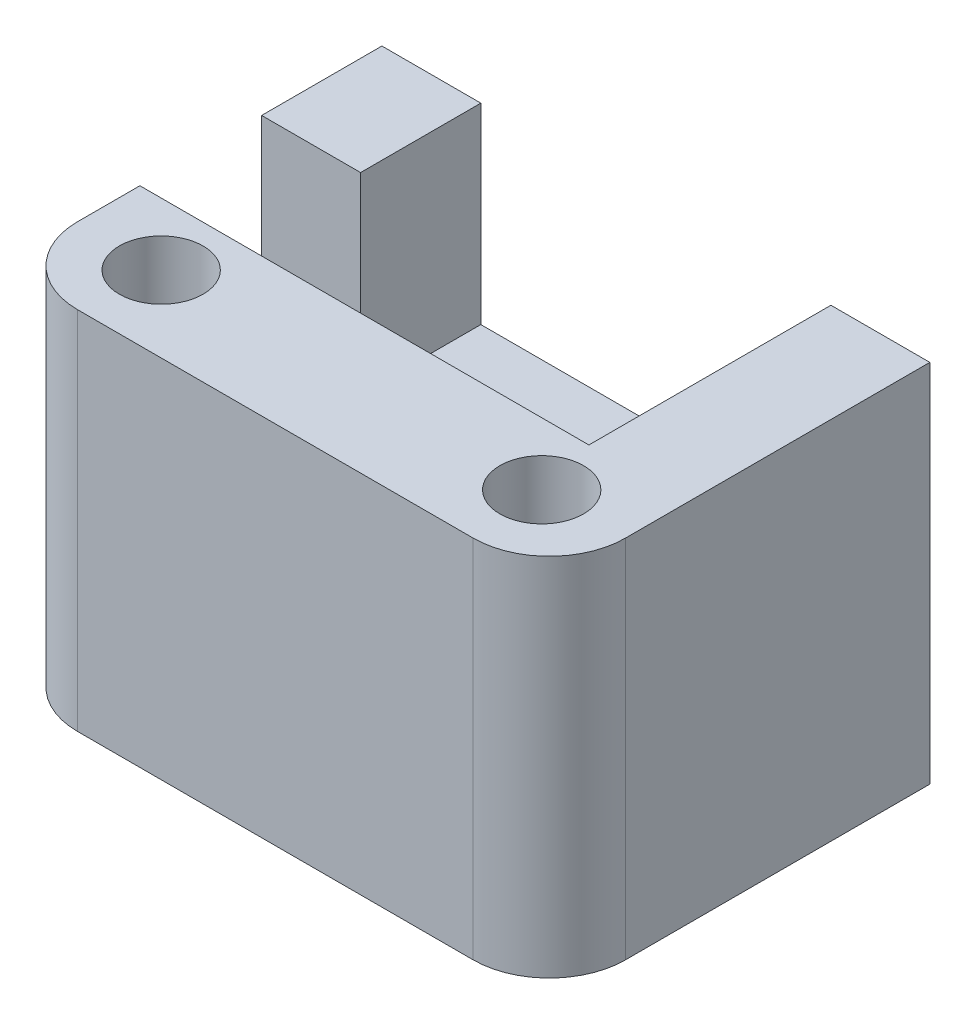
ISO-10303-21;
HEADER;
FILE_DESCRIPTION(('STEP AP214'),'2;1');
FILE_NAME('part.step','',(''),(''),'','','');
FILE_SCHEMA(('AUTOMOTIVE_DESIGN { 1 0 10303 214 1 1 1 1 }'));
ENDSEC;
DATA;
#1=APPLICATION_CONTEXT('core data for automotive mechanical design processes');
#2=APPLICATION_PROTOCOL_DEFINITION('international standard','automotive_design',2000,#1);
#3=PRODUCT_CONTEXT('',#1,'mechanical');
#4=PRODUCT('Part','Part','',(#3));
#5=PRODUCT_RELATED_PRODUCT_CATEGORY('part','',(#4));
#6=PRODUCT_DEFINITION_FORMATION('','',#4);
#7=PRODUCT_DEFINITION_CONTEXT('part definition',#1,'design');
#8=PRODUCT_DEFINITION('design','',#6,#7);
#9=PRODUCT_DEFINITION_SHAPE('','',#8);
#10=(LENGTH_UNIT() NAMED_UNIT(*) SI_UNIT(.MILLI.,.METRE.));
#11=(NAMED_UNIT(*) PLANE_ANGLE_UNIT() SI_UNIT($,.RADIAN.));
#12=(NAMED_UNIT(*) SI_UNIT($,.STERADIAN.) SOLID_ANGLE_UNIT());
#13=UNCERTAINTY_MEASURE_WITH_UNIT(LENGTH_MEASURE(1.E-05),#10,'distance_accuracy_value','');
#14=(GEOMETRIC_REPRESENTATION_CONTEXT(3) GLOBAL_UNCERTAINTY_ASSIGNED_CONTEXT((#13)) GLOBAL_UNIT_ASSIGNED_CONTEXT((#10,
#11,#12)) REPRESENTATION_CONTEXT('',''));
#15=CARTESIAN_POINT('',(0.,0.,0.));
#16=DIRECTION('',(0.,0.,1.));
#17=DIRECTION('',(1.,0.,0.));
#18=AXIS2_PLACEMENT_3D('',#15,#16,#17);
#19=CARTESIAN_POINT('',(0.,24.,0.));
#20=DIRECTION('',(0.,-1.,0.));
#21=DIRECTION('',(0.,0.,-1.));
#22=AXIS2_PLACEMENT_3D('',#19,#20,#21);
#23=PLANE('',#22);
#24=CARTESIAN_POINT('',(5.5,24.,-5.));
#25=DIRECTION('',(0.,1.,0.));
#26=DIRECTION('',(0.,0.,1.));
#27=AXIS2_PLACEMENT_3D('',#24,#25,#26);
#28=CIRCLE('',#27,2.75);
#29=CARTESIAN_POINT('',(5.5,24.,-2.25));
#30=VERTEX_POINT('',#29);
#31=EDGE_CURVE('E359',#30,#30,#28,.T.);
#32=ORIENTED_EDGE('',*,*,#31,.F.);
#33=EDGE_LOOP('',(#32));
#34=FACE_BOUND('',#33,.T.);
#35=CARTESIAN_POINT('',(30.5,24.,-5.));
#36=DIRECTION('',(0.,1.,0.));
#37=DIRECTION('',(0.,0.,1.));
#38=AXIS2_PLACEMENT_3D('',#35,#36,#37);
#39=CIRCLE('',#38,2.75);
#40=CARTESIAN_POINT('',(30.5,24.,-2.25));
#41=VERTEX_POINT('',#40);
#42=EDGE_CURVE('E347',#41,#41,#39,.T.);
#43=ORIENTED_EDGE('',*,*,#42,.F.);
#44=EDGE_LOOP('',(#43));
#45=FACE_BOUND('',#44,.T.);
#46=DIRECTION('',(0.,0.,1.));
#47=VECTOR('',#46,1.);
#48=CARTESIAN_POINT('',(0.,24.,0.));
#49=LINE('',#48,#47);
#50=CARTESIAN_POINT('',(0.,24.,-9.1));
#51=VERTEX_POINT('',#50);
#52=CARTESIAN_POINT('',(0.,24.,-5.));
#53=VERTEX_POINT('',#52);
#54=EDGE_CURVE('E157',#51,#53,#49,.T.);
#55=ORIENTED_EDGE('',*,*,#54,.T.);
#56=CARTESIAN_POINT('',(5.,24.,-5.));
#57=DIRECTION('',(0.,-1.,0.));
#58=DIRECTION('',(0.,0.,-1.));
#59=AXIS2_PLACEMENT_3D('',#56,#57,#58);
#60=CIRCLE('',#59,5.);
#61=CARTESIAN_POINT('',(5.,24.,0.));
#62=VERTEX_POINT('',#61);
#63=EDGE_CURVE('E14',#53,#62,#60,.F.);
#64=ORIENTED_EDGE('',*,*,#63,.T.);
#65=DIRECTION('',(1.,0.,0.));
#66=VECTOR('',#65,1.);
#67=CARTESIAN_POINT('',(0.,24.,0.));
#68=LINE('',#67,#66);
#69=CARTESIAN_POINT('',(31.,24.,0.));
#70=VERTEX_POINT('',#69);
#71=EDGE_CURVE('E180',#62,#70,#68,.T.);
#72=ORIENTED_EDGE('',*,*,#71,.T.);
#73=CARTESIAN_POINT('',(31.,24.,-5.));
#74=DIRECTION('',(0.,-1.,0.));
#75=DIRECTION('',(0.,0.,-1.));
#76=AXIS2_PLACEMENT_3D('',#73,#74,#75);
#77=CIRCLE('',#76,5.);
#78=CARTESIAN_POINT('',(36.,24.,-5.));
#79=VERTEX_POINT('',#78);
#80=EDGE_CURVE('E214',#70,#79,#77,.F.);
#81=ORIENTED_EDGE('',*,*,#80,.T.);
#82=DIRECTION('',(0.,0.,-1.));
#83=VECTOR('',#82,1.);
#84=CARTESIAN_POINT('',(36.,24.,0.));
#85=LINE('',#84,#83);
#86=CARTESIAN_POINT('',(36.,24.,-25.));
#87=VERTEX_POINT('',#86);
#88=EDGE_CURVE('E188',#79,#87,#85,.T.);
#89=ORIENTED_EDGE('',*,*,#88,.T.);
#90=DIRECTION('',(-1.,0.,0.));
#91=VECTOR('',#90,1.);
#92=CARTESIAN_POINT('',(0.,24.,-25.));
#93=LINE('',#92,#91);
#94=CARTESIAN_POINT('',(29.5,24.,-25.));
#95=VERTEX_POINT('',#94);
#96=EDGE_CURVE('E191',#87,#95,#93,.T.);
#97=ORIENTED_EDGE('',*,*,#96,.T.);
#98=DIRECTION('',(0.,0.,-1.));
#99=VECTOR('',#98,1.);
#100=CARTESIAN_POINT('',(29.5,24.,-25.));
#101=LINE('',#100,#99);
#102=CARTESIAN_POINT('',(29.5,24.,-9.1));
#103=VERTEX_POINT('',#102);
#104=EDGE_CURVE('E160',#103,#95,#101,.T.);
#105=ORIENTED_EDGE('',*,*,#104,.F.);
#106=DIRECTION('',(1.,0.,0.));
#107=VECTOR('',#106,1.);
#108=CARTESIAN_POINT('',(6.5,24.,-9.1));
#109=LINE('',#108,#107);
#110=EDGE_CURVE('E155',#51,#103,#109,.T.);
#111=ORIENTED_EDGE('',*,*,#110,.F.);
#112=EDGE_LOOP('',(#55,#64,#72,#81,#89,#97,#105,#111));
#113=FACE_BOUND('',#112,.T.);
#114=ADVANCED_FACE('F49',(#34,#45,#113),#23,.F.);
#115=CARTESIAN_POINT('',(0.,24.,0.));
#116=DIRECTION('',(1.,0.,0.));
#117=DIRECTION('',(0.,0.,-1.));
#118=AXIS2_PLACEMENT_3D('',#115,#116,#117);
#119=PLANE('',#118);
#120=DIRECTION('',(0.,0.,1.));
#121=VECTOR('',#120,1.);
#122=CARTESIAN_POINT('',(0.,0.,0.));
#123=LINE('',#122,#121);
#124=CARTESIAN_POINT('',(0.,0.,-25.));
#125=VERTEX_POINT('',#124);
#126=CARTESIAN_POINT('',(0.,0.,-5.));
#127=VERTEX_POINT('',#126);
#128=EDGE_CURVE('E194',#125,#127,#123,.T.);
#129=ORIENTED_EDGE('',*,*,#128,.T.);
#130=DIRECTION('',(0.,-1.,0.));
#131=VECTOR('',#130,1.);
#132=CARTESIAN_POINT('',(0.,24.,-5.));
#133=LINE('',#132,#131);
#134=EDGE_CURVE('E57',#127,#53,#133,.F.);
#135=ORIENTED_EDGE('',*,*,#134,.T.);
#136=ORIENTED_EDGE('',*,*,#54,.F.);
#137=DIRECTION('',(0.,1.,0.));
#138=VECTOR('',#137,1.);
#139=CARTESIAN_POINT('',(0.,24.,-9.1));
#140=LINE('',#139,#138);
#141=CARTESIAN_POINT('',(0.,14.,-9.1));
#142=VERTEX_POINT('',#141);
#143=EDGE_CURVE('E167',#142,#51,#140,.T.);
#144=ORIENTED_EDGE('',*,*,#143,.F.);
#145=DIRECTION('',(0.,0.,1.));
#146=VECTOR('',#145,1.);
#147=CARTESIAN_POINT('',(0.,14.,-9.1));
#148=LINE('',#147,#146);
#149=CARTESIAN_POINT('',(0.,14.,-17.1));
#150=VERTEX_POINT('',#149);
#151=EDGE_CURVE('E332',#150,#142,#148,.T.);
#152=ORIENTED_EDGE('',*,*,#151,.F.);
#153=DIRECTION('',(0.,-1.,0.));
#154=VECTOR('',#153,1.);
#155=CARTESIAN_POINT('',(0.,24.,-17.1));
#156=LINE('',#155,#154);
#157=CARTESIAN_POINT('',(0.,24.,-17.1));
#158=VERTEX_POINT('',#157);
#159=EDGE_CURVE('E173',#158,#150,#156,.T.);
#160=ORIENTED_EDGE('',*,*,#159,.F.);
#161=CARTESIAN_POINT('',(0.,24.,-25.));
#162=VERTEX_POINT('',#161);
#163=EDGE_CURVE('E176',#162,#158,#49,.T.);
#164=ORIENTED_EDGE('',*,*,#163,.F.);
#165=DIRECTION('',(0.,-1.,0.));
#166=VECTOR('',#165,1.);
#167=CARTESIAN_POINT('',(0.,24.,-25.));
#168=LINE('',#167,#166);
#169=EDGE_CURVE('E193',#162,#125,#168,.T.);
#170=ORIENTED_EDGE('',*,*,#169,.T.);
#171=EDGE_LOOP('',(#129,#135,#136,#144,#152,#160,#164,#170));
#172=FACE_BOUND('',#171,.T.);
#173=ADVANCED_FACE('F175',(#172),#119,.F.);
#174=CARTESIAN_POINT('',(0.,24.,0.));
#175=DIRECTION('',(0.,0.,-1.));
#176=DIRECTION('',(-1.,0.,0.));
#177=AXIS2_PLACEMENT_3D('',#174,#175,#176);
#178=PLANE('',#177);
#179=ORIENTED_EDGE('',*,*,#71,.F.);
#180=DIRECTION('',(0.,-1.,0.));
#181=VECTOR('',#180,1.);
#182=CARTESIAN_POINT('',(5.,24.,0.));
#183=LINE('',#182,#181);
#184=CARTESIAN_POINT('',(5.,0.,0.));
#185=VERTEX_POINT('',#184);
#186=EDGE_CURVE('E222',#62,#185,#183,.T.);
#187=ORIENTED_EDGE('',*,*,#186,.T.);
#188=DIRECTION('',(1.,0.,0.));
#189=VECTOR('',#188,1.);
#190=CARTESIAN_POINT('',(0.,0.,0.));
#191=LINE('',#190,#189);
#192=CARTESIAN_POINT('',(31.,0.,0.));
#193=VERTEX_POINT('',#192);
#194=EDGE_CURVE('E196',#185,#193,#191,.T.);
#195=ORIENTED_EDGE('',*,*,#194,.T.);
#196=DIRECTION('',(0.,-1.,0.));
#197=VECTOR('',#196,1.);
#198=CARTESIAN_POINT('',(31.,24.,0.));
#199=LINE('',#198,#197);
#200=EDGE_CURVE('E211',#193,#70,#199,.F.);
#201=ORIENTED_EDGE('',*,*,#200,.T.);
#202=EDGE_LOOP('',(#179,#187,#195,#201));
#203=FACE_BOUND('',#202,.T.);
#204=ADVANCED_FACE('F228',(#203),#178,.F.);
#205=CARTESIAN_POINT('',(36.,24.,0.));
#206=DIRECTION('',(-1.,0.,0.));
#207=DIRECTION('',(0.,0.,1.));
#208=AXIS2_PLACEMENT_3D('',#205,#206,#207);
#209=PLANE('',#208);
#210=ORIENTED_EDGE('',*,*,#88,.F.);
#211=DIRECTION('',(0.,-1.,0.));
#212=VECTOR('',#211,1.);
#213=CARTESIAN_POINT('',(36.,24.,-5.));
#214=LINE('',#213,#212);
#215=CARTESIAN_POINT('',(36.,0.,-5.));
#216=VERTEX_POINT('',#215);
#217=EDGE_CURVE('E205',#79,#216,#214,.T.);
#218=ORIENTED_EDGE('',*,*,#217,.T.);
#219=DIRECTION('',(0.,0.,-1.));
#220=VECTOR('',#219,1.);
#221=CARTESIAN_POINT('',(36.,0.,0.));
#222=LINE('',#221,#220);
#223=CARTESIAN_POINT('',(36.,0.,-25.));
#224=VERTEX_POINT('',#223);
#225=EDGE_CURVE('E181',#216,#224,#222,.T.);
#226=ORIENTED_EDGE('',*,*,#225,.T.);
#227=DIRECTION('',(0.,-1.,0.));
#228=VECTOR('',#227,1.);
#229=CARTESIAN_POINT('',(36.,24.,-25.));
#230=LINE('',#229,#228);
#231=EDGE_CURVE('E202',#87,#224,#230,.T.);
#232=ORIENTED_EDGE('',*,*,#231,.F.);
#233=EDGE_LOOP('',(#210,#218,#226,#232));
#234=FACE_BOUND('',#233,.T.);
#235=ADVANCED_FACE('F241',(#234),#209,.F.);
#236=CARTESIAN_POINT('',(0.,24.,-25.));
#237=DIRECTION('',(0.,0.,1.));
#238=DIRECTION('',(1.,0.,0.));
#239=AXIS2_PLACEMENT_3D('',#236,#237,#238);
#240=PLANE('',#239);
#241=CARTESIAN_POINT('',(32.5,17.7,-25.));
#242=DIRECTION('',(0.,0.,-1.));
#243=DIRECTION('',(-1.,0.,0.));
#244=AXIS2_PLACEMENT_3D('',#241,#242,#243);
#245=CIRCLE('',#244,1.025);
#246=CARTESIAN_POINT('',(31.475,17.7,-25.));
#247=VERTEX_POINT('',#246);
#248=EDGE_CURVE('E371',#247,#247,#245,.T.);
#249=ORIENTED_EDGE('',*,*,#248,.F.);
#250=EDGE_LOOP('',(#249));
#251=FACE_BOUND('',#250,.T.);
#252=CARTESIAN_POINT('',(3.5,17.7,-25.));
#253=DIRECTION('',(0.,0.,-1.));
#254=DIRECTION('',(-1.,0.,0.));
#255=AXIS2_PLACEMENT_3D('',#252,#253,#254);
#256=CIRCLE('',#255,1.025);
#257=CARTESIAN_POINT('',(2.475,17.7,-25.));
#258=VERTEX_POINT('',#257);
#259=EDGE_CURVE('E376',#258,#258,#256,.T.);
#260=ORIENTED_EDGE('',*,*,#259,.F.);
#261=EDGE_LOOP('',(#260));
#262=FACE_BOUND('',#261,.T.);
#263=CARTESIAN_POINT('',(6.5,24.,-25.));
#264=VERTEX_POINT('',#263);
#265=EDGE_CURVE('E190',#264,#162,#93,.T.);
#266=ORIENTED_EDGE('',*,*,#265,.F.);
#267=DIRECTION('',(0.,1.,0.));
#268=VECTOR('',#267,1.);
#269=CARTESIAN_POINT('',(6.5,11.4,-25.));
#270=LINE('',#269,#268);
#271=CARTESIAN_POINT('',(6.5,11.4,-25.));
#272=VERTEX_POINT('',#271);
#273=EDGE_CURVE('E197',#272,#264,#270,.T.);
#274=ORIENTED_EDGE('',*,*,#273,.F.);
#275=DIRECTION('',(-1.,0.,0.));
#276=VECTOR('',#275,1.);
#277=CARTESIAN_POINT('',(6.5,11.4,-25.));
#278=LINE('',#277,#276);
#279=CARTESIAN_POINT('',(29.5,11.4,-25.));
#280=VERTEX_POINT('',#279);
#281=EDGE_CURVE('E251',#280,#272,#278,.T.);
#282=ORIENTED_EDGE('',*,*,#281,.F.);
#283=DIRECTION('',(0.,1.,0.));
#284=VECTOR('',#283,1.);
#285=CARTESIAN_POINT('',(29.5,11.4,-25.));
#286=LINE('',#285,#284);
#287=EDGE_CURVE('E248',#280,#95,#286,.T.);
#288=ORIENTED_EDGE('',*,*,#287,.T.);
#289=ORIENTED_EDGE('',*,*,#96,.F.);
#290=ORIENTED_EDGE('',*,*,#231,.T.);
#291=DIRECTION('',(-1.,0.,0.));
#292=VECTOR('',#291,1.);
#293=CARTESIAN_POINT('',(0.,0.,-25.));
#294=LINE('',#293,#292);
#295=EDGE_CURVE('E177',#224,#125,#294,.T.);
#296=ORIENTED_EDGE('',*,*,#295,.T.);
#297=ORIENTED_EDGE('',*,*,#169,.F.);
#298=EDGE_LOOP('',(#266,#274,#282,#288,#289,#290,#296,#297));
#299=FACE_BOUND('',#298,.T.);
#300=ADVANCED_FACE('F246',(#251,#262,#299),#240,.F.);
#301=ORIENTED_EDGE('',*,*,#163,.T.);
#302=DIRECTION('',(-1.,0.,0.));
#303=VECTOR('',#302,1.);
#304=CARTESIAN_POINT('',(10.,24.,-17.1));
#305=LINE('',#304,#303);
#306=CARTESIAN_POINT('',(6.5,24.,-17.1));
#307=VERTEX_POINT('',#306);
#308=EDGE_CURVE('E328',#307,#158,#305,.T.);
#309=ORIENTED_EDGE('',*,*,#308,.F.);
#310=DIRECTION('',(0.,0.,1.));
#311=VECTOR('',#310,1.);
#312=CARTESIAN_POINT('',(6.5,24.,-25.));
#313=LINE('',#312,#311);
#314=EDGE_CURVE('E164',#264,#307,#313,.T.);
#315=ORIENTED_EDGE('',*,*,#314,.F.);
#316=ORIENTED_EDGE('',*,*,#265,.T.);
#317=EDGE_LOOP('',(#301,#309,#315,#316));
#318=FACE_BOUND('',#317,.T.);
#319=ADVANCED_FACE('F308',(#318),#23,.F.);
#320=CARTESIAN_POINT('',(0.,0.,0.));
#321=DIRECTION('',(0.,-1.,0.));
#322=DIRECTION('',(0.,0.,-1.));
#323=AXIS2_PLACEMENT_3D('',#320,#321,#322);
#324=PLANE('',#323);
#325=CARTESIAN_POINT('',(30.5,0.,-5.));
#326=DIRECTION('',(0.,1.,0.));
#327=DIRECTION('',(0.,0.,1.));
#328=AXIS2_PLACEMENT_3D('',#325,#326,#327);
#329=CIRCLE('',#328,1.49999999999999);
#330=CARTESIAN_POINT('',(30.5,0.,-3.50000000000001));
#331=VERTEX_POINT('',#330);
#332=EDGE_CURVE('E356',#331,#331,#329,.T.);
#333=ORIENTED_EDGE('',*,*,#332,.T.);
#334=EDGE_LOOP('',(#333));
#335=FACE_BOUND('',#334,.T.);
#336=CARTESIAN_POINT('',(5.5,0.,-5.));
#337=DIRECTION('',(0.,1.,0.));
#338=DIRECTION('',(0.,0.,1.));
#339=AXIS2_PLACEMENT_3D('',#336,#337,#338);
#340=CIRCLE('',#339,1.49999999999999);
#341=CARTESIAN_POINT('',(5.5,0.,-3.5));
#342=VERTEX_POINT('',#341);
#343=EDGE_CURVE('E368',#342,#342,#340,.T.);
#344=ORIENTED_EDGE('',*,*,#343,.T.);
#345=EDGE_LOOP('',(#344));
#346=FACE_BOUND('',#345,.T.);
#347=ORIENTED_EDGE('',*,*,#194,.F.);
#348=CARTESIAN_POINT('',(5.,0.,-5.));
#349=DIRECTION('',(0.,-1.,0.));
#350=DIRECTION('',(0.,0.,-1.));
#351=AXIS2_PLACEMENT_3D('',#348,#349,#350);
#352=CIRCLE('',#351,5.);
#353=EDGE_CURVE('E71',#185,#127,#352,.T.);
#354=ORIENTED_EDGE('',*,*,#353,.T.);
#355=ORIENTED_EDGE('',*,*,#128,.F.);
#356=ORIENTED_EDGE('',*,*,#295,.F.);
#357=ORIENTED_EDGE('',*,*,#225,.F.);
#358=CARTESIAN_POINT('',(31.,0.,-5.));
#359=DIRECTION('',(0.,-1.,0.));
#360=DIRECTION('',(0.,0.,-1.));
#361=AXIS2_PLACEMENT_3D('',#358,#359,#360);
#362=CIRCLE('',#361,5.);
#363=EDGE_CURVE('E208',#216,#193,#362,.T.);
#364=ORIENTED_EDGE('',*,*,#363,.T.);
#365=EDGE_LOOP('',(#347,#354,#355,#356,#357,#364));
#366=FACE_BOUND('',#365,.T.);
#367=ADVANCED_FACE('F230',(#335,#346,#366),#324,.T.);
#368=CARTESIAN_POINT('',(6.5,11.4,-25.));
#369=DIRECTION('',(-1.,0.,0.));
#370=DIRECTION('',(0.,0.,1.));
#371=AXIS2_PLACEMENT_3D('',#368,#369,#370);
#372=PLANE('',#371);
#373=DIRECTION('',(0.,-1.,0.));
#374=VECTOR('',#373,1.);
#375=CARTESIAN_POINT('',(6.5,11.4,-17.1));
#376=LINE('',#375,#374);
#377=CARTESIAN_POINT('',(6.5,14.,-17.1));
#378=VERTEX_POINT('',#377);
#379=EDGE_CURVE('E219',#307,#378,#376,.T.);
#380=ORIENTED_EDGE('',*,*,#379,.T.);
#381=DIRECTION('',(0.,0.,1.));
#382=VECTOR('',#381,1.);
#383=CARTESIAN_POINT('',(6.5,14.,-25.));
#384=LINE('',#383,#382);
#385=CARTESIAN_POINT('',(6.5,14.,-14.1));
#386=VERTEX_POINT('',#385);
#387=EDGE_CURVE('E344',#378,#386,#384,.T.);
#388=ORIENTED_EDGE('',*,*,#387,.T.);
#389=DIRECTION('',(0.,1.,0.));
#390=VECTOR('',#389,1.);
#391=CARTESIAN_POINT('',(6.5,11.4,-14.1));
#392=LINE('',#391,#390);
#393=CARTESIAN_POINT('',(6.5,11.4,-14.1));
#394=VERTEX_POINT('',#393);
#395=EDGE_CURVE('E185',#394,#386,#392,.T.);
#396=ORIENTED_EDGE('',*,*,#395,.F.);
#397=DIRECTION('',(0.,0.,1.));
#398=VECTOR('',#397,1.);
#399=CARTESIAN_POINT('',(6.5,11.4,-25.));
#400=LINE('',#399,#398);
#401=EDGE_CURVE('E280',#272,#394,#400,.T.);
#402=ORIENTED_EDGE('',*,*,#401,.F.);
#403=ORIENTED_EDGE('',*,*,#273,.T.);
#404=ORIENTED_EDGE('',*,*,#314,.T.);
#405=EDGE_LOOP('',(#380,#388,#396,#402,#403,#404));
#406=FACE_BOUND('',#405,.T.);
#407=ADVANCED_FACE('F294',(#406),#372,.F.);
#408=CARTESIAN_POINT('',(29.5,11.4,-25.));
#409=DIRECTION('',(1.,0.,0.));
#410=DIRECTION('',(0.,0.,-1.));
#411=AXIS2_PLACEMENT_3D('',#408,#409,#410);
#412=PLANE('',#411);
#413=ORIENTED_EDGE('',*,*,#104,.T.);
#414=ORIENTED_EDGE('',*,*,#287,.F.);
#415=DIRECTION('',(0.,0.,-1.));
#416=VECTOR('',#415,1.);
#417=CARTESIAN_POINT('',(29.5,11.4,-25.));
#418=LINE('',#417,#416);
#419=CARTESIAN_POINT('',(29.5,11.4,-9.1));
#420=VERTEX_POINT('',#419);
#421=EDGE_CURVE('E270',#420,#280,#418,.T.);
#422=ORIENTED_EDGE('',*,*,#421,.F.);
#423=DIRECTION('',(0.,1.,0.));
#424=VECTOR('',#423,1.);
#425=CARTESIAN_POINT('',(29.5,11.4,-9.1));
#426=LINE('',#425,#424);
#427=EDGE_CURVE('E255',#420,#103,#426,.T.);
#428=ORIENTED_EDGE('',*,*,#427,.T.);
#429=EDGE_LOOP('',(#413,#414,#422,#428));
#430=FACE_BOUND('',#429,.T.);
#431=ADVANCED_FACE('F292',(#430),#412,.F.);
#432=CARTESIAN_POINT('',(6.5,11.4,-9.1));
#433=DIRECTION('',(0.,0.,1.));
#434=DIRECTION('',(1.,0.,0.));
#435=AXIS2_PLACEMENT_3D('',#432,#433,#434);
#436=PLANE('',#435);
#437=DIRECTION('',(0.,1.,0.));
#438=VECTOR('',#437,1.);
#439=CARTESIAN_POINT('',(5.5,11.4,-9.1));
#440=LINE('',#439,#438);
#441=CARTESIAN_POINT('',(5.5,11.4,-9.1));
#442=VERTEX_POINT('',#441);
#443=CARTESIAN_POINT('',(5.5,14.,-9.1));
#444=VERTEX_POINT('',#443);
#445=EDGE_CURVE('E258',#442,#444,#440,.T.);
#446=ORIENTED_EDGE('',*,*,#445,.T.);
#447=DIRECTION('',(-1.,0.,0.));
#448=VECTOR('',#447,1.);
#449=CARTESIAN_POINT('',(10.,14.,-9.1));
#450=LINE('',#449,#448);
#451=EDGE_CURVE('E170',#444,#142,#450,.T.);
#452=ORIENTED_EDGE('',*,*,#451,.T.);
#453=ORIENTED_EDGE('',*,*,#143,.T.);
#454=ORIENTED_EDGE('',*,*,#110,.T.);
#455=ORIENTED_EDGE('',*,*,#427,.F.);
#456=DIRECTION('',(1.,0.,0.));
#457=VECTOR('',#456,1.);
#458=CARTESIAN_POINT('',(6.5,11.4,-9.1));
#459=LINE('',#458,#457);
#460=EDGE_CURVE('E274',#442,#420,#459,.T.);
#461=ORIENTED_EDGE('',*,*,#460,.F.);
#462=EDGE_LOOP('',(#446,#452,#453,#454,#455,#461));
#463=FACE_BOUND('',#462,.T.);
#464=ADVANCED_FACE('F169',(#463),#436,.F.);
#465=CARTESIAN_POINT('',(5.5,11.4,-9.1));
#466=DIRECTION('',(-1.,0.,0.));
#467=DIRECTION('',(0.,0.,1.));
#468=AXIS2_PLACEMENT_3D('',#465,#466,#467);
#469=PLANE('',#468);
#470=DIRECTION('',(0.,1.,0.));
#471=VECTOR('',#470,1.);
#472=CARTESIAN_POINT('',(5.5,11.4,-14.1));
#473=LINE('',#472,#471);
#474=CARTESIAN_POINT('',(5.5,11.4,-14.1));
#475=VERTEX_POINT('',#474);
#476=CARTESIAN_POINT('',(5.5,14.,-14.1));
#477=VERTEX_POINT('',#476);
#478=EDGE_CURVE('E262',#475,#477,#473,.T.);
#479=ORIENTED_EDGE('',*,*,#478,.T.);
#480=DIRECTION('',(0.,0.,1.));
#481=VECTOR('',#480,1.);
#482=CARTESIAN_POINT('',(5.5,14.,-9.1));
#483=LINE('',#482,#481);
#484=EDGE_CURVE('E339',#477,#444,#483,.T.);
#485=ORIENTED_EDGE('',*,*,#484,.T.);
#486=ORIENTED_EDGE('',*,*,#445,.F.);
#487=DIRECTION('',(0.,0.,1.));
#488=VECTOR('',#487,1.);
#489=CARTESIAN_POINT('',(5.5,11.4,-9.1));
#490=LINE('',#489,#488);
#491=EDGE_CURVE('E284',#475,#442,#490,.T.);
#492=ORIENTED_EDGE('',*,*,#491,.F.);
#493=EDGE_LOOP('',(#479,#485,#486,#492));
#494=FACE_BOUND('',#493,.T.);
#495=ADVANCED_FACE('F300',(#494),#469,.F.);
#496=CARTESIAN_POINT('',(6.5,11.4,-14.1));
#497=DIRECTION('',(0.,0.,-1.));
#498=DIRECTION('',(-1.,0.,0.));
#499=AXIS2_PLACEMENT_3D('',#496,#497,#498);
#500=PLANE('',#499);
#501=ORIENTED_EDGE('',*,*,#395,.T.);
#502=DIRECTION('',(-1.,0.,0.));
#503=VECTOR('',#502,1.);
#504=CARTESIAN_POINT('',(6.5,14.,-14.1));
#505=LINE('',#504,#503);
#506=EDGE_CURVE('E216',#386,#477,#505,.T.);
#507=ORIENTED_EDGE('',*,*,#506,.T.);
#508=ORIENTED_EDGE('',*,*,#478,.F.);
#509=DIRECTION('',(-1.,0.,0.));
#510=VECTOR('',#509,1.);
#511=CARTESIAN_POINT('',(6.5,11.4,-14.1));
#512=LINE('',#511,#510);
#513=EDGE_CURVE('E281',#394,#475,#512,.T.);
#514=ORIENTED_EDGE('',*,*,#513,.F.);
#515=EDGE_LOOP('',(#501,#507,#508,#514));
#516=FACE_BOUND('',#515,.T.);
#517=ADVANCED_FACE('F399',(#516),#500,.F.);
#518=CARTESIAN_POINT('',(0.,11.4,0.));
#519=DIRECTION('',(0.,-1.,0.));
#520=DIRECTION('',(0.,0.,-1.));
#521=AXIS2_PLACEMENT_3D('',#518,#519,#520);
#522=PLANE('',#521);
#523=ORIENTED_EDGE('',*,*,#401,.T.);
#524=ORIENTED_EDGE('',*,*,#513,.T.);
#525=ORIENTED_EDGE('',*,*,#491,.T.);
#526=ORIENTED_EDGE('',*,*,#460,.T.);
#527=ORIENTED_EDGE('',*,*,#421,.T.);
#528=ORIENTED_EDGE('',*,*,#281,.T.);
#529=EDGE_LOOP('',(#523,#524,#525,#526,#527,#528));
#530=FACE_BOUND('',#529,.T.);
#531=ADVANCED_FACE('F291',(#530),#522,.F.);
#532=CARTESIAN_POINT('',(3.5,17.7,-19.));
#533=DIRECTION('',(0.,0.,1.));
#534=DIRECTION('',(1.,0.,0.));
#535=AXIS2_PLACEMENT_3D('',#532,#533,#534);
#536=PLANE('',#535);
#537=CARTESIAN_POINT('',(3.5,17.7,-19.));
#538=DIRECTION('',(0.,0.,-1.));
#539=DIRECTION('',(-1.,0.,0.));
#540=AXIS2_PLACEMENT_3D('',#537,#538,#539);
#541=CIRCLE('',#540,1.025);
#542=CARTESIAN_POINT('',(2.475,17.7,-19.));
#543=VERTEX_POINT('',#542);
#544=EDGE_CURVE('E279',#543,#543,#541,.T.);
#545=ORIENTED_EDGE('',*,*,#544,.T.);
#546=EDGE_LOOP('',(#545));
#547=FACE_BOUND('',#546,.T.);
#548=ADVANCED_FACE('F383',(#547),#536,.F.);
#549=CARTESIAN_POINT('',(3.5,17.7,-25.));
#550=DIRECTION('',(0.,0.,-1.));
#551=DIRECTION('',(-1.,0.,0.));
#552=AXIS2_PLACEMENT_3D('',#549,#550,#551);
#553=CYLINDRICAL_SURFACE('',#552,1.025);
#554=ORIENTED_EDGE('',*,*,#544,.F.);
#555=EDGE_LOOP('',(#554));
#556=FACE_BOUND('',#555,.T.);
#557=ORIENTED_EDGE('',*,*,#259,.T.);
#558=EDGE_LOOP('',(#557));
#559=FACE_BOUND('',#558,.T.);
#560=ADVANCED_FACE('F385',(#556,#559),#553,.F.);
#561=CARTESIAN_POINT('',(32.5,17.7,-19.));
#562=DIRECTION('',(0.,0.,1.));
#563=DIRECTION('',(1.,0.,0.));
#564=AXIS2_PLACEMENT_3D('',#561,#562,#563);
#565=PLANE('',#564);
#566=CARTESIAN_POINT('',(32.5,17.7,-19.));
#567=DIRECTION('',(0.,0.,-1.));
#568=DIRECTION('',(-1.,0.,0.));
#569=AXIS2_PLACEMENT_3D('',#566,#567,#568);
#570=CIRCLE('',#569,1.025);
#571=CARTESIAN_POINT('',(31.475,17.7,-19.));
#572=VERTEX_POINT('',#571);
#573=EDGE_CURVE('E374',#572,#572,#570,.T.);
#574=ORIENTED_EDGE('',*,*,#573,.T.);
#575=EDGE_LOOP('',(#574));
#576=FACE_BOUND('',#575,.T.);
#577=ADVANCED_FACE('F387',(#576),#565,.F.);
#578=CARTESIAN_POINT('',(32.5,17.7,-25.));
#579=DIRECTION('',(0.,0.,-1.));
#580=DIRECTION('',(-1.,0.,0.));
#581=AXIS2_PLACEMENT_3D('',#578,#579,#580);
#582=CYLINDRICAL_SURFACE('',#581,1.025);
#583=ORIENTED_EDGE('',*,*,#573,.F.);
#584=EDGE_LOOP('',(#583));
#585=FACE_BOUND('',#584,.T.);
#586=ORIENTED_EDGE('',*,*,#248,.T.);
#587=EDGE_LOOP('',(#586));
#588=FACE_BOUND('',#587,.T.);
#589=ADVANCED_FACE('F393',(#585,#588),#582,.F.);
#590=CARTESIAN_POINT('',(31.,24.,-5.));
#591=DIRECTION('',(0.,-1.,0.));
#592=DIRECTION('',(0.,0.,-1.));
#593=AXIS2_PLACEMENT_3D('',#590,#591,#592);
#594=CYLINDRICAL_SURFACE('',#593,5.);
#595=ORIENTED_EDGE('',*,*,#80,.F.);
#596=ORIENTED_EDGE('',*,*,#200,.F.);
#597=ORIENTED_EDGE('',*,*,#363,.F.);
#598=ORIENTED_EDGE('',*,*,#217,.F.);
#599=EDGE_LOOP('',(#595,#596,#597,#598));
#600=FACE_BOUND('',#599,.T.);
#601=ADVANCED_FACE('F237',(#600),#594,.T.);
#602=CARTESIAN_POINT('',(5.5,24.,-5.));
#603=DIRECTION('',(0.,1.,0.));
#604=DIRECTION('',(0.,0.,1.));
#605=AXIS2_PLACEMENT_3D('',#602,#603,#604);
#606=CYLINDRICAL_SURFACE('',#605,1.5);
#607=ORIENTED_EDGE('',*,*,#343,.F.);
#608=EDGE_LOOP('',(#607));
#609=FACE_BOUND('',#608,.T.);
#610=CARTESIAN_POINT('',(5.5,20.,-5.));
#611=DIRECTION('',(0.,1.,0.));
#612=DIRECTION('',(0.,0.,1.));
#613=AXIS2_PLACEMENT_3D('',#610,#611,#612);
#614=CIRCLE('',#613,1.5);
#615=CARTESIAN_POINT('',(5.5,20.,-3.5));
#616=VERTEX_POINT('',#615);
#617=EDGE_CURVE('E365',#616,#616,#614,.T.);
#618=ORIENTED_EDGE('',*,*,#617,.T.);
#619=EDGE_LOOP('',(#618));
#620=FACE_BOUND('',#619,.T.);
#621=ADVANCED_FACE('F463',(#609,#620),#606,.F.);
#622=CARTESIAN_POINT('',(7.,20.,-5.));
#623=DIRECTION('',(0.,-1.,0.));
#624=DIRECTION('',(0.,0.,-1.));
#625=AXIS2_PLACEMENT_3D('',#622,#623,#624);
#626=PLANE('',#625);
#627=ORIENTED_EDGE('',*,*,#617,.F.);
#628=EDGE_LOOP('',(#627));
#629=FACE_BOUND('',#628,.T.);
#630=CARTESIAN_POINT('',(5.5,20.,-5.));
#631=DIRECTION('',(0.,1.,0.));
#632=DIRECTION('',(0.,0.,1.));
#633=AXIS2_PLACEMENT_3D('',#630,#631,#632);
#634=CIRCLE('',#633,2.75);
#635=CARTESIAN_POINT('',(5.5,20.,-2.25));
#636=VERTEX_POINT('',#635);
#637=EDGE_CURVE('E362',#636,#636,#634,.T.);
#638=ORIENTED_EDGE('',*,*,#637,.T.);
#639=EDGE_LOOP('',(#638));
#640=FACE_BOUND('',#639,.T.);
#641=ADVANCED_FACE('F506',(#629,#640),#626,.F.);
#642=CARTESIAN_POINT('',(5.5,24.,-5.));
#643=DIRECTION('',(0.,1.,0.));
#644=DIRECTION('',(0.,0.,1.));
#645=AXIS2_PLACEMENT_3D('',#642,#643,#644);
#646=CYLINDRICAL_SURFACE('',#645,2.75);
#647=ORIENTED_EDGE('',*,*,#637,.F.);
#648=EDGE_LOOP('',(#647));
#649=FACE_BOUND('',#648,.T.);
#650=ORIENTED_EDGE('',*,*,#31,.T.);
#651=EDGE_LOOP('',(#650));
#652=FACE_BOUND('',#651,.T.);
#653=ADVANCED_FACE('F496',(#649,#652),#646,.F.);
#654=CARTESIAN_POINT('',(30.5,24.,-5.));
#655=DIRECTION('',(0.,1.,0.));
#656=DIRECTION('',(0.,0.,1.));
#657=AXIS2_PLACEMENT_3D('',#654,#655,#656);
#658=CYLINDRICAL_SURFACE('',#657,1.5);
#659=ORIENTED_EDGE('',*,*,#332,.F.);
#660=EDGE_LOOP('',(#659));
#661=FACE_BOUND('',#660,.T.);
#662=CARTESIAN_POINT('',(30.5,20.,-5.));
#663=DIRECTION('',(0.,1.,0.));
#664=DIRECTION('',(0.,0.,1.));
#665=AXIS2_PLACEMENT_3D('',#662,#663,#664);
#666=CIRCLE('',#665,1.5);
#667=CARTESIAN_POINT('',(30.5,20.,-3.5));
#668=VERTEX_POINT('',#667);
#669=EDGE_CURVE('E353',#668,#668,#666,.T.);
#670=ORIENTED_EDGE('',*,*,#669,.T.);
#671=EDGE_LOOP('',(#670));
#672=FACE_BOUND('',#671,.T.);
#673=ADVANCED_FACE('F486',(#661,#672),#658,.F.);
#674=CARTESIAN_POINT('',(32.,20.,-5.));
#675=DIRECTION('',(0.,-1.,0.));
#676=DIRECTION('',(0.,0.,-1.));
#677=AXIS2_PLACEMENT_3D('',#674,#675,#676);
#678=PLANE('',#677);
#679=ORIENTED_EDGE('',*,*,#669,.F.);
#680=EDGE_LOOP('',(#679));
#681=FACE_BOUND('',#680,.T.);
#682=CARTESIAN_POINT('',(30.5,20.,-5.));
#683=DIRECTION('',(0.,1.,0.));
#684=DIRECTION('',(0.,0.,1.));
#685=AXIS2_PLACEMENT_3D('',#682,#683,#684);
#686=CIRCLE('',#685,2.75);
#687=CARTESIAN_POINT('',(30.5,20.,-2.25));
#688=VERTEX_POINT('',#687);
#689=EDGE_CURVE('E350',#688,#688,#686,.T.);
#690=ORIENTED_EDGE('',*,*,#689,.T.);
#691=EDGE_LOOP('',(#690));
#692=FACE_BOUND('',#691,.T.);
#693=ADVANCED_FACE('F475',(#681,#692),#678,.F.);
#694=CARTESIAN_POINT('',(30.5,24.,-5.));
#695=DIRECTION('',(0.,1.,0.));
#696=DIRECTION('',(0.,0.,1.));
#697=AXIS2_PLACEMENT_3D('',#694,#695,#696);
#698=CYLINDRICAL_SURFACE('',#697,2.75);
#699=ORIENTED_EDGE('',*,*,#689,.F.);
#700=EDGE_LOOP('',(#699));
#701=FACE_BOUND('',#700,.T.);
#702=ORIENTED_EDGE('',*,*,#42,.T.);
#703=EDGE_LOOP('',(#702));
#704=FACE_BOUND('',#703,.T.);
#705=ADVANCED_FACE('F469',(#701,#704),#698,.F.);
#706=CARTESIAN_POINT('',(10.,24.,-17.1));
#707=DIRECTION('',(0.,0.,-1.));
#708=DIRECTION('',(0.,1.,0.));
#709=AXIS2_PLACEMENT_3D('',#706,#707,#708);
#710=PLANE('',#709);
#711=ORIENTED_EDGE('',*,*,#308,.T.);
#712=ORIENTED_EDGE('',*,*,#159,.T.);
#713=DIRECTION('',(-1.,0.,0.));
#714=VECTOR('',#713,1.);
#715=CARTESIAN_POINT('',(10.,14.,-17.1));
#716=LINE('',#715,#714);
#717=EDGE_CURVE('E340',#378,#150,#716,.T.);
#718=ORIENTED_EDGE('',*,*,#717,.F.);
#719=ORIENTED_EDGE('',*,*,#379,.F.);
#720=EDGE_LOOP('',(#711,#712,#718,#719));
#721=FACE_BOUND('',#720,.T.);
#722=ADVANCED_FACE('F474',(#721),#710,.F.);
#723=CARTESIAN_POINT('',(10.,14.,-9.1));
#724=DIRECTION('',(0.,-1.,0.));
#725=DIRECTION('',(0.,0.,-1.));
#726=AXIS2_PLACEMENT_3D('',#723,#724,#725);
#727=PLANE('',#726);
#728=ORIENTED_EDGE('',*,*,#717,.T.);
#729=ORIENTED_EDGE('',*,*,#151,.T.);
#730=ORIENTED_EDGE('',*,*,#451,.F.);
#731=ORIENTED_EDGE('',*,*,#484,.F.);
#732=ORIENTED_EDGE('',*,*,#506,.F.);
#733=ORIENTED_EDGE('',*,*,#387,.F.);
#734=EDGE_LOOP('',(#728,#729,#730,#731,#732,#733));
#735=FACE_BOUND('',#734,.T.);
#736=ADVANCED_FACE('F528',(#735),#727,.F.);
#737=CARTESIAN_POINT('',(5.,24.,-5.));
#738=DIRECTION('',(0.,-1.,0.));
#739=DIRECTION('',(0.,0.,-1.));
#740=AXIS2_PLACEMENT_3D('',#737,#738,#739);
#741=CYLINDRICAL_SURFACE('',#740,5.);
#742=ORIENTED_EDGE('',*,*,#63,.F.);
#743=ORIENTED_EDGE('',*,*,#134,.F.);
#744=ORIENTED_EDGE('',*,*,#353,.F.);
#745=ORIENTED_EDGE('',*,*,#186,.F.);
#746=EDGE_LOOP('',(#742,#743,#744,#745));
#747=FACE_BOUND('',#746,.T.);
#748=ADVANCED_FACE('F51',(#747),#741,.T.);
#749=CLOSED_SHELL('',(#114,#173,#204,#235,#300,#319,#367,#407,#431,#464,#495,#517,#531,#548,
#560,#577,#589,#601,#621,#641,#653,#673,#693,#705,#722,#736,#748));
#750=MANIFOLD_SOLID_BREP('B2',#749);
#751=ADVANCED_BREP_SHAPE_REPRESENTATION('',(#18,#750),#14);
#752=SHAPE_DEFINITION_REPRESENTATION(#9,#751);
ENDSEC;
END-ISO-10303-21;
